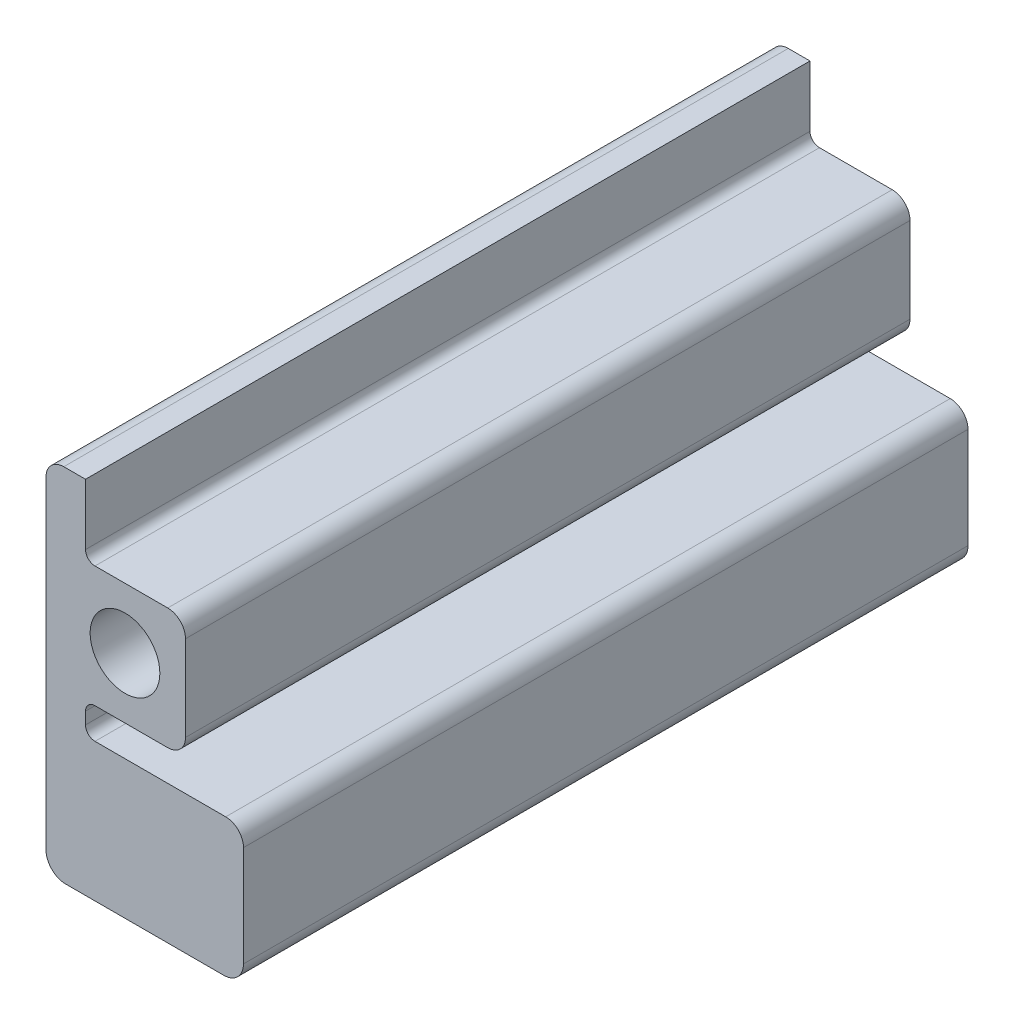
ISO-10303-21;
HEADER;
FILE_DESCRIPTION(('STEP AP214'),'2;1');
FILE_NAME('part.step','',(''),(''),'','','');
FILE_SCHEMA(('AUTOMOTIVE_DESIGN { 1 0 10303 214 1 1 1 1 }'));
ENDSEC;
DATA;
#1=APPLICATION_CONTEXT('core data for automotive mechanical design processes');
#2=APPLICATION_PROTOCOL_DEFINITION('international standard','automotive_design',2000,#1);
#3=PRODUCT_CONTEXT('',#1,'mechanical');
#4=PRODUCT('Part','Part','',(#3));
#5=PRODUCT_RELATED_PRODUCT_CATEGORY('part','',(#4));
#6=PRODUCT_DEFINITION_FORMATION('','',#4);
#7=PRODUCT_DEFINITION_CONTEXT('part definition',#1,'design');
#8=PRODUCT_DEFINITION('design','',#6,#7);
#9=PRODUCT_DEFINITION_SHAPE('','',#8);
#10=(LENGTH_UNIT() NAMED_UNIT(*) SI_UNIT(.MILLI.,.METRE.));
#11=(NAMED_UNIT(*) PLANE_ANGLE_UNIT() SI_UNIT($,.RADIAN.));
#12=(NAMED_UNIT(*) SI_UNIT($,.STERADIAN.) SOLID_ANGLE_UNIT());
#13=UNCERTAINTY_MEASURE_WITH_UNIT(LENGTH_MEASURE(1.E-05),#10,'distance_accuracy_value','');
#14=(GEOMETRIC_REPRESENTATION_CONTEXT(3) GLOBAL_UNCERTAINTY_ASSIGNED_CONTEXT((#13)) GLOBAL_UNIT_ASSIGNED_CONTEXT((#10,
#11,#12)) REPRESENTATION_CONTEXT('',''));
#15=CARTESIAN_POINT('',(0.,0.,0.));
#16=DIRECTION('',(0.,0.,1.));
#17=DIRECTION('',(1.,0.,0.));
#18=AXIS2_PLACEMENT_3D('',#15,#16,#17);
#19=CARTESIAN_POINT('',(-9.65199999999999,-22.503,232.947291788));
#20=DIRECTION('',(0.,0.,-1.));
#21=DIRECTION('',(-1.,0.,0.));
#22=AXIS2_PLACEMENT_3D('',#19,#20,#21);
#23=PLANE('',#22);
#24=DIRECTION('',(0.,1.,0.));
#25=VECTOR('',#24,1.);
#26=CARTESIAN_POINT('',(-12.7,22.503,232.947291788));
#27=LINE('',#26,#25);
#28=CARTESIAN_POINT('',(-12.7,22.503,232.947291788));
#29=VERTEX_POINT('',#28);
#30=CARTESIAN_POINT('',(-12.7,42.08,232.947291788));
#31=VERTEX_POINT('',#30);
#32=EDGE_CURVE('E322',#29,#31,#27,.T.);
#33=ORIENTED_EDGE('',*,*,#32,.T.);
#34=DIRECTION('',(-1.,0.,0.));
#35=VECTOR('',#34,1.);
#36=CARTESIAN_POINT('',(32.385,42.08,232.947291788));
#37=LINE('',#36,#35);
#38=CARTESIAN_POINT('',(-19.685,42.08,232.947291788));
#39=VERTEX_POINT('',#38);
#40=EDGE_CURVE('E324',#31,#39,#37,.T.);
#41=ORIENTED_EDGE('',*,*,#40,.T.);
#42=CARTESIAN_POINT('',(-19.685,36.365,232.947291788));
#43=DIRECTION('',(0.,0.,1.));
#44=DIRECTION('',(1.,0.,0.));
#45=AXIS2_PLACEMENT_3D('',#42,#43,#44);
#46=CIRCLE('',#45,5.71499999999999);
#47=CARTESIAN_POINT('',(-25.4,36.365,232.947291788));
#48=VERTEX_POINT('',#47);
#49=EDGE_CURVE('E326',#39,#48,#46,.T.);
#50=ORIENTED_EDGE('',*,*,#49,.T.);
#51=DIRECTION('',(0.,-1.,0.));
#52=VECTOR('',#51,1.);
#53=CARTESIAN_POINT('',(-25.4,-67.479999962,232.947291788));
#54=LINE('',#53,#52);
#55=CARTESIAN_POINT('',(-25.4,-67.479999962,232.947291788));
#56=VERTEX_POINT('',#55);
#57=EDGE_CURVE('E328',#48,#56,#54,.T.);
#58=ORIENTED_EDGE('',*,*,#57,.T.);
#59=CARTESIAN_POINT('',(-19.05,-67.479999962,232.947291788));
#60=DIRECTION('',(0.,0.,1.));
#61=DIRECTION('',(-1.,0.,0.));
#62=AXIS2_PLACEMENT_3D('',#59,#60,#61);
#63=CIRCLE('',#62,6.35);
#64=CARTESIAN_POINT('',(-19.05,-73.829999962,232.947291788));
#65=VERTEX_POINT('',#64);
#66=EDGE_CURVE('E330',#56,#65,#63,.T.);
#67=ORIENTED_EDGE('',*,*,#66,.T.);
#68=DIRECTION('',(1.,0.,0.));
#69=VECTOR('',#68,1.);
#70=CARTESIAN_POINT('',(31.75,-73.829999962,232.947291788));
#71=LINE('',#70,#69);
#72=CARTESIAN_POINT('',(31.75,-73.829999962,232.947291788));
#73=VERTEX_POINT('',#72);
#74=EDGE_CURVE('E332',#65,#73,#71,.T.);
#75=ORIENTED_EDGE('',*,*,#74,.T.);
#76=CARTESIAN_POINT('',(31.75,-67.479999962,232.947291788));
#77=DIRECTION('',(0.,0.,1.));
#78=DIRECTION('',(1.,0.,0.));
#79=AXIS2_PLACEMENT_3D('',#76,#77,#78);
#80=CIRCLE('',#79,6.35);
#81=CARTESIAN_POINT('',(38.1,-67.479999962,232.947291788));
#82=VERTEX_POINT('',#81);
#83=EDGE_CURVE('E334',#73,#82,#80,.T.);
#84=ORIENTED_EDGE('',*,*,#83,.T.);
#85=DIRECTION('',(0.,1.,0.));
#86=VECTOR('',#85,1.);
#87=CARTESIAN_POINT('',(38.1,-67.479999962,232.947291788));
#88=LINE('',#87,#86);
#89=CARTESIAN_POINT('',(38.1,-35.094999962,232.947291788));
#90=VERTEX_POINT('',#89);
#91=EDGE_CURVE('E336',#82,#90,#88,.T.);
#92=ORIENTED_EDGE('',*,*,#91,.T.);
#93=CARTESIAN_POINT('',(32.385,-35.094999962,232.947291788));
#94=DIRECTION('',(0.,0.,1.));
#95=DIRECTION('',(1.,0.,0.));
#96=AXIS2_PLACEMENT_3D('',#93,#94,#95);
#97=CIRCLE('',#96,5.71499999999999);
#98=CARTESIAN_POINT('',(32.385,-29.379999962,232.947291788));
#99=VERTEX_POINT('',#98);
#100=EDGE_CURVE('E338',#90,#99,#97,.T.);
#101=ORIENTED_EDGE('',*,*,#100,.T.);
#102=DIRECTION('',(-1.,0.,0.));
#103=VECTOR('',#102,1.);
#104=CARTESIAN_POINT('',(32.385,-29.379999962,232.947291788));
#105=LINE('',#104,#103);
#106=CARTESIAN_POINT('',(-9.65199999999999,-29.379999962,232.947291788));
#107=VERTEX_POINT('',#106);
#108=EDGE_CURVE('E194',#99,#107,#105,.T.);
#109=ORIENTED_EDGE('',*,*,#108,.T.);
#110=CARTESIAN_POINT('',(-9.65199999999999,-26.331999962,232.947291788));
#111=DIRECTION('',(0.,0.,-1.));
#112=DIRECTION('',(-1.,0.,0.));
#113=AXIS2_PLACEMENT_3D('',#110,#111,#112);
#114=CIRCLE('',#113,3.048);
#115=CARTESIAN_POINT('',(-12.7,-26.331999962,232.947291788));
#116=VERTEX_POINT('',#115);
#117=EDGE_CURVE('E186',#107,#116,#114,.T.);
#118=ORIENTED_EDGE('',*,*,#117,.T.);
#119=DIRECTION('',(0.,1.,0.));
#120=VECTOR('',#119,1.);
#121=CARTESIAN_POINT('',(-12.7,-26.331999962,232.947291788));
#122=LINE('',#121,#120);
#123=CARTESIAN_POINT('',(-12.7,-22.503,232.947291788));
#124=VERTEX_POINT('',#123);
#125=EDGE_CURVE('E191',#116,#124,#122,.T.);
#126=ORIENTED_EDGE('',*,*,#125,.T.);
#127=CARTESIAN_POINT('',(-9.65199999999999,-22.503,232.947291788));
#128=DIRECTION('',(0.,0.,-1.));
#129=DIRECTION('',(-1.,0.,0.));
#130=AXIS2_PLACEMENT_3D('',#127,#128,#129);
#131=CIRCLE('',#130,3.048);
#132=CARTESIAN_POINT('',(-9.65199999999999,-19.455,232.947291788));
#133=VERTEX_POINT('',#132);
#134=EDGE_CURVE('E211',#124,#133,#131,.T.);
#135=ORIENTED_EDGE('',*,*,#134,.T.);
#136=DIRECTION('',(1.,0.,0.));
#137=VECTOR('',#136,1.);
#138=CARTESIAN_POINT('',(13.74,-19.455,232.947291788));
#139=LINE('',#138,#137);
#140=CARTESIAN_POINT('',(13.74,-19.455,232.947291788));
#141=VERTEX_POINT('',#140);
#142=EDGE_CURVE('E68',#133,#141,#139,.T.);
#143=ORIENTED_EDGE('',*,*,#142,.T.);
#144=CARTESIAN_POINT('',(13.74,-13.74,232.947291788));
#145=DIRECTION('',(0.,0.,1.));
#146=DIRECTION('',(-1.,0.,0.));
#147=AXIS2_PLACEMENT_3D('',#144,#145,#146);
#148=CIRCLE('',#147,5.715);
#149=CARTESIAN_POINT('',(19.455,-13.74,232.947291788));
#150=VERTEX_POINT('',#149);
#151=EDGE_CURVE('E141',#141,#150,#148,.T.);
#152=ORIENTED_EDGE('',*,*,#151,.T.);
#153=DIRECTION('',(0.,1.,0.));
#154=VECTOR('',#153,1.);
#155=CARTESIAN_POINT('',(19.455,0.,232.947291788));
#156=LINE('',#155,#154);
#157=CARTESIAN_POINT('',(19.455,13.74,232.947291788));
#158=VERTEX_POINT('',#157);
#159=EDGE_CURVE('E314',#150,#158,#156,.T.);
#160=ORIENTED_EDGE('',*,*,#159,.T.);
#161=CARTESIAN_POINT('',(13.74,13.74,232.947291788));
#162=DIRECTION('',(0.,0.,1.));
#163=DIRECTION('',(-1.,0.,0.));
#164=AXIS2_PLACEMENT_3D('',#161,#162,#163);
#165=CIRCLE('',#164,5.715);
#166=CARTESIAN_POINT('',(13.74,19.455,232.947291788));
#167=VERTEX_POINT('',#166);
#168=EDGE_CURVE('E311',#158,#167,#165,.T.);
#169=ORIENTED_EDGE('',*,*,#168,.T.);
#170=DIRECTION('',(-1.,0.,0.));
#171=VECTOR('',#170,1.);
#172=CARTESIAN_POINT('',(0.,19.455,232.947291788));
#173=LINE('',#172,#171);
#174=CARTESIAN_POINT('',(-9.65199999999999,19.455,232.947291788));
#175=VERTEX_POINT('',#174);
#176=EDGE_CURVE('E313',#167,#175,#173,.T.);
#177=ORIENTED_EDGE('',*,*,#176,.T.);
#178=CARTESIAN_POINT('',(-9.65199999999999,22.503,232.947291788));
#179=DIRECTION('',(0.,0.,-1.));
#180=DIRECTION('',(-1.,0.,0.));
#181=AXIS2_PLACEMENT_3D('',#178,#179,#180);
#182=CIRCLE('',#181,3.048);
#183=EDGE_CURVE('E316',#175,#29,#182,.T.);
#184=ORIENTED_EDGE('',*,*,#183,.T.);
#185=EDGE_LOOP('',(#33,#41,#50,#58,#67,#75,#84,#92,#101,#109,#118,#126,#135,#143,#152,#160,#169,
#177,#184));
#186=FACE_BOUND('',#185,.T.);
#187=CARTESIAN_POINT('',(0.,0.,232.947291788));
#188=DIRECTION('',(0.,0.,1.));
#189=DIRECTION('',(1.,0.,0.));
#190=AXIS2_PLACEMENT_3D('',#187,#188,#189);
#191=CIRCLE('',#190,11.2);
#192=CARTESIAN_POINT('',(11.2,0.,232.947291788));
#193=VERTEX_POINT('',#192);
#194=EDGE_CURVE('E221',#193,#193,#191,.T.);
#195=ORIENTED_EDGE('',*,*,#194,.F.);
#196=EDGE_LOOP('',(#195));
#197=FACE_BOUND('',#196,.T.);
#198=ADVANCED_FACE('F45',(#186,#197),#23,.F.);
#199=CARTESIAN_POINT('',(-9.65199999999999,-22.503,0.));
#200=DIRECTION('',(0.,0.,-1.));
#201=DIRECTION('',(-1.,0.,0.));
#202=AXIS2_PLACEMENT_3D('',#199,#200,#201);
#203=PLANE('',#202);
#204=DIRECTION('',(-1.,0.,0.));
#205=VECTOR('',#204,1.);
#206=CARTESIAN_POINT('',(32.385,42.08,0.));
#207=LINE('',#206,#205);
#208=CARTESIAN_POINT('',(-12.7,42.08,0.));
#209=VERTEX_POINT('',#208);
#210=CARTESIAN_POINT('',(-19.685,42.08,0.));
#211=VERTEX_POINT('',#210);
#212=EDGE_CURVE('E231',#209,#211,#207,.T.);
#213=ORIENTED_EDGE('',*,*,#212,.F.);
#214=DIRECTION('',(0.,1.,0.));
#215=VECTOR('',#214,1.);
#216=CARTESIAN_POINT('',(-12.7,22.503,0.));
#217=LINE('',#216,#215);
#218=CARTESIAN_POINT('',(-12.7,22.503,0.));
#219=VERTEX_POINT('',#218);
#220=EDGE_CURVE('E60',#219,#209,#217,.T.);
#221=ORIENTED_EDGE('',*,*,#220,.F.);
#222=CARTESIAN_POINT('',(-9.65199999999999,22.503,0.));
#223=DIRECTION('',(0.,0.,-1.));
#224=DIRECTION('',(-1.,0.,0.));
#225=AXIS2_PLACEMENT_3D('',#222,#223,#224);
#226=CIRCLE('',#225,3.048);
#227=CARTESIAN_POINT('',(-9.65199999999999,19.455,0.));
#228=VERTEX_POINT('',#227);
#229=EDGE_CURVE('E228',#228,#219,#226,.T.);
#230=ORIENTED_EDGE('',*,*,#229,.F.);
#231=DIRECTION('',(-1.,0.,0.));
#232=VECTOR('',#231,1.);
#233=CARTESIAN_POINT('',(-9.65199999999999,19.455,0.));
#234=LINE('',#233,#232);
#235=CARTESIAN_POINT('',(13.74,19.455,0.));
#236=VERTEX_POINT('',#235);
#237=EDGE_CURVE('E226',#236,#228,#234,.T.);
#238=ORIENTED_EDGE('',*,*,#237,.F.);
#239=CARTESIAN_POINT('',(13.74,13.74,0.));
#240=DIRECTION('',(0.,0.,1.));
#241=DIRECTION('',(-1.,0.,0.));
#242=AXIS2_PLACEMENT_3D('',#239,#240,#241);
#243=CIRCLE('',#242,5.715);
#244=CARTESIAN_POINT('',(19.455,13.74,0.));
#245=VERTEX_POINT('',#244);
#246=EDGE_CURVE('E223',#245,#236,#243,.T.);
#247=ORIENTED_EDGE('',*,*,#246,.F.);
#248=DIRECTION('',(0.,1.,0.));
#249=VECTOR('',#248,1.);
#250=CARTESIAN_POINT('',(19.455,13.74,0.));
#251=LINE('',#250,#249);
#252=CARTESIAN_POINT('',(19.455,-13.74,0.));
#253=VERTEX_POINT('',#252);
#254=EDGE_CURVE('E220',#253,#245,#251,.T.);
#255=ORIENTED_EDGE('',*,*,#254,.F.);
#256=CARTESIAN_POINT('',(13.74,-13.74,0.));
#257=DIRECTION('',(0.,0.,1.));
#258=DIRECTION('',(-1.,0.,0.));
#259=AXIS2_PLACEMENT_3D('',#256,#257,#258);
#260=CIRCLE('',#259,5.715);
#261=CARTESIAN_POINT('',(13.74,-19.455,0.));
#262=VERTEX_POINT('',#261);
#263=EDGE_CURVE('E217',#262,#253,#260,.T.);
#264=ORIENTED_EDGE('',*,*,#263,.F.);
#265=DIRECTION('',(1.,0.,0.));
#266=VECTOR('',#265,1.);
#267=CARTESIAN_POINT('',(-9.65199999999999,-19.455,0.));
#268=LINE('',#267,#266);
#269=CARTESIAN_POINT('',(-9.65199999999999,-19.455,0.));
#270=VERTEX_POINT('',#269);
#271=EDGE_CURVE('E253',#270,#262,#268,.T.);
#272=ORIENTED_EDGE('',*,*,#271,.F.);
#273=CARTESIAN_POINT('',(-9.65199999999999,-22.503,0.));
#274=DIRECTION('',(0.,0.,-1.));
#275=DIRECTION('',(-1.,0.,0.));
#276=AXIS2_PLACEMENT_3D('',#273,#274,#275);
#277=CIRCLE('',#276,3.048);
#278=CARTESIAN_POINT('',(-12.7,-22.503,0.));
#279=VERTEX_POINT('',#278);
#280=EDGE_CURVE('E133',#279,#270,#277,.T.);
#281=ORIENTED_EDGE('',*,*,#280,.F.);
#282=DIRECTION('',(0.,1.,0.));
#283=VECTOR('',#282,1.);
#284=CARTESIAN_POINT('',(-12.7,-26.331999962,0.));
#285=LINE('',#284,#283);
#286=CARTESIAN_POINT('',(-12.7,-26.331999962,0.));
#287=VERTEX_POINT('',#286);
#288=EDGE_CURVE('E250',#287,#279,#285,.T.);
#289=ORIENTED_EDGE('',*,*,#288,.F.);
#290=CARTESIAN_POINT('',(-9.65199999999999,-26.331999962,0.));
#291=DIRECTION('',(0.,0.,-1.));
#292=DIRECTION('',(-1.,0.,0.));
#293=AXIS2_PLACEMENT_3D('',#290,#291,#292);
#294=CIRCLE('',#293,3.048);
#295=CARTESIAN_POINT('',(-9.65199999999999,-29.379999962,0.));
#296=VERTEX_POINT('',#295);
#297=EDGE_CURVE('E203',#296,#287,#294,.T.);
#298=ORIENTED_EDGE('',*,*,#297,.F.);
#299=DIRECTION('',(-1.,0.,0.));
#300=VECTOR('',#299,1.);
#301=CARTESIAN_POINT('',(32.385,-29.379999962,0.));
#302=LINE('',#301,#300);
#303=CARTESIAN_POINT('',(32.385,-29.379999962,0.));
#304=VERTEX_POINT('',#303);
#305=EDGE_CURVE('E247',#304,#296,#302,.T.);
#306=ORIENTED_EDGE('',*,*,#305,.F.);
#307=CARTESIAN_POINT('',(32.385,-35.094999962,0.));
#308=DIRECTION('',(0.,0.,1.));
#309=DIRECTION('',(1.,0.,0.));
#310=AXIS2_PLACEMENT_3D('',#307,#308,#309);
#311=CIRCLE('',#310,5.71499999999999);
#312=CARTESIAN_POINT('',(38.1,-35.094999962,0.));
#313=VERTEX_POINT('',#312);
#314=EDGE_CURVE('E245',#313,#304,#311,.T.);
#315=ORIENTED_EDGE('',*,*,#314,.F.);
#316=DIRECTION('',(0.,1.,0.));
#317=VECTOR('',#316,1.);
#318=CARTESIAN_POINT('',(38.1,-67.479999962,0.));
#319=LINE('',#318,#317);
#320=CARTESIAN_POINT('',(38.1,-67.479999962,0.));
#321=VERTEX_POINT('',#320);
#322=EDGE_CURVE('E243',#321,#313,#319,.T.);
#323=ORIENTED_EDGE('',*,*,#322,.F.);
#324=CARTESIAN_POINT('',(31.75,-67.479999962,0.));
#325=DIRECTION('',(0.,0.,1.));
#326=DIRECTION('',(1.,0.,0.));
#327=AXIS2_PLACEMENT_3D('',#324,#325,#326);
#328=CIRCLE('',#327,6.35);
#329=CARTESIAN_POINT('',(31.75,-73.829999962,0.));
#330=VERTEX_POINT('',#329);
#331=EDGE_CURVE('E241',#330,#321,#328,.T.);
#332=ORIENTED_EDGE('',*,*,#331,.F.);
#333=DIRECTION('',(1.,0.,0.));
#334=VECTOR('',#333,1.);
#335=CARTESIAN_POINT('',(31.75,-73.829999962,0.));
#336=LINE('',#335,#334);
#337=CARTESIAN_POINT('',(-19.05,-73.829999962,0.));
#338=VERTEX_POINT('',#337);
#339=EDGE_CURVE('E239',#338,#330,#336,.T.);
#340=ORIENTED_EDGE('',*,*,#339,.F.);
#341=CARTESIAN_POINT('',(-19.05,-67.479999962,0.));
#342=DIRECTION('',(0.,0.,1.));
#343=DIRECTION('',(-1.,0.,0.));
#344=AXIS2_PLACEMENT_3D('',#341,#342,#343);
#345=CIRCLE('',#344,6.35);
#346=CARTESIAN_POINT('',(-25.4,-67.479999962,0.));
#347=VERTEX_POINT('',#346);
#348=EDGE_CURVE('E237',#347,#338,#345,.T.);
#349=ORIENTED_EDGE('',*,*,#348,.F.);
#350=DIRECTION('',(0.,-1.,0.));
#351=VECTOR('',#350,1.);
#352=CARTESIAN_POINT('',(-25.4,-67.479999962,0.));
#353=LINE('',#352,#351);
#354=CARTESIAN_POINT('',(-25.4,36.365,0.));
#355=VERTEX_POINT('',#354);
#356=EDGE_CURVE('E235',#355,#347,#353,.T.);
#357=ORIENTED_EDGE('',*,*,#356,.F.);
#358=CARTESIAN_POINT('',(-19.685,36.365,0.));
#359=DIRECTION('',(0.,0.,1.));
#360=DIRECTION('',(1.,0.,0.));
#361=AXIS2_PLACEMENT_3D('',#358,#359,#360);
#362=CIRCLE('',#361,5.71499999999999);
#363=EDGE_CURVE('E233',#211,#355,#362,.T.);
#364=ORIENTED_EDGE('',*,*,#363,.F.);
#365=EDGE_LOOP('',(#213,#221,#230,#238,#247,#255,#264,#272,#281,#289,#298,#306,#315,#323,#332,
#340,#349,#357,#364));
#366=FACE_BOUND('',#365,.T.);
#367=CARTESIAN_POINT('',(0.,0.,0.));
#368=DIRECTION('',(0.,0.,1.));
#369=DIRECTION('',(1.,0.,0.));
#370=AXIS2_PLACEMENT_3D('',#367,#368,#369);
#371=CIRCLE('',#370,11.2);
#372=CARTESIAN_POINT('',(11.2,0.,0.));
#373=VERTEX_POINT('',#372);
#374=EDGE_CURVE('E352',#373,#373,#371,.T.);
#375=ORIENTED_EDGE('',*,*,#374,.T.);
#376=EDGE_LOOP('',(#375));
#377=FACE_BOUND('',#376,.T.);
#378=ADVANCED_FACE('F300',(#366,#377),#203,.T.);
#379=CARTESIAN_POINT('',(13.74,-13.74,232.947291788));
#380=DIRECTION('',(0.,0.,-1.));
#381=DIRECTION('',(-1.,0.,0.));
#382=AXIS2_PLACEMENT_3D('',#379,#380,#381);
#383=CYLINDRICAL_SURFACE('',#382,5.715);
#384=ORIENTED_EDGE('',*,*,#263,.T.);
#385=DIRECTION('',(0.,0.,-1.));
#386=VECTOR('',#385,1.);
#387=CARTESIAN_POINT('',(19.455,-13.74,232.947291788));
#388=LINE('',#387,#386);
#389=EDGE_CURVE('E293',#150,#253,#388,.T.);
#390=ORIENTED_EDGE('',*,*,#389,.F.);
#391=ORIENTED_EDGE('',*,*,#151,.F.);
#392=DIRECTION('',(0.,0.,-1.));
#393=VECTOR('',#392,1.);
#394=CARTESIAN_POINT('',(13.74,-19.455,232.947291788));
#395=LINE('',#394,#393);
#396=EDGE_CURVE('E53',#141,#262,#395,.T.);
#397=ORIENTED_EDGE('',*,*,#396,.T.);
#398=EDGE_LOOP('',(#384,#390,#391,#397));
#399=FACE_BOUND('',#398,.T.);
#400=ADVANCED_FACE('F47',(#399),#383,.T.);
#401=CARTESIAN_POINT('',(19.455,13.74,232.947291788));
#402=DIRECTION('',(-1.,0.,0.));
#403=DIRECTION('',(0.,0.,1.));
#404=AXIS2_PLACEMENT_3D('',#401,#402,#403);
#405=PLANE('',#404);
#406=ORIENTED_EDGE('',*,*,#254,.T.);
#407=DIRECTION('',(0.,0.,-1.));
#408=VECTOR('',#407,1.);
#409=CARTESIAN_POINT('',(19.455,13.74,232.947291788));
#410=LINE('',#409,#408);
#411=EDGE_CURVE('E290',#158,#245,#410,.T.);
#412=ORIENTED_EDGE('',*,*,#411,.F.);
#413=ORIENTED_EDGE('',*,*,#159,.F.);
#414=ORIENTED_EDGE('',*,*,#389,.T.);
#415=EDGE_LOOP('',(#406,#412,#413,#414));
#416=FACE_BOUND('',#415,.T.);
#417=ADVANCED_FACE('F305',(#416),#405,.F.);
#418=CARTESIAN_POINT('',(13.74,13.74,232.947291788));
#419=DIRECTION('',(0.,0.,-1.));
#420=DIRECTION('',(-1.,0.,0.));
#421=AXIS2_PLACEMENT_3D('',#418,#419,#420);
#422=CYLINDRICAL_SURFACE('',#421,5.715);
#423=ORIENTED_EDGE('',*,*,#246,.T.);
#424=DIRECTION('',(0.,0.,-1.));
#425=VECTOR('',#424,1.);
#426=CARTESIAN_POINT('',(13.74,19.455,232.947291788));
#427=LINE('',#426,#425);
#428=EDGE_CURVE('E287',#167,#236,#427,.T.);
#429=ORIENTED_EDGE('',*,*,#428,.F.);
#430=ORIENTED_EDGE('',*,*,#168,.F.);
#431=ORIENTED_EDGE('',*,*,#411,.T.);
#432=EDGE_LOOP('',(#423,#429,#430,#431));
#433=FACE_BOUND('',#432,.T.);
#434=ADVANCED_FACE('F309',(#433),#422,.T.);
#435=CARTESIAN_POINT('',(-9.65199999999999,19.455,232.947291788));
#436=DIRECTION('',(0.,-1.,0.));
#437=DIRECTION('',(1.,0.,0.));
#438=AXIS2_PLACEMENT_3D('',#435,#436,#437);
#439=PLANE('',#438);
#440=ORIENTED_EDGE('',*,*,#237,.T.);
#441=DIRECTION('',(0.,0.,-1.));
#442=VECTOR('',#441,1.);
#443=CARTESIAN_POINT('',(-9.65199999999999,19.455,232.947291788));
#444=LINE('',#443,#442);
#445=EDGE_CURVE('E284',#175,#228,#444,.T.);
#446=ORIENTED_EDGE('',*,*,#445,.F.);
#447=ORIENTED_EDGE('',*,*,#176,.F.);
#448=ORIENTED_EDGE('',*,*,#428,.T.);
#449=EDGE_LOOP('',(#440,#446,#447,#448));
#450=FACE_BOUND('',#449,.T.);
#451=ADVANCED_FACE('F415',(#450),#439,.F.);
#452=CARTESIAN_POINT('',(-9.65199999999999,22.503,232.947291788));
#453=DIRECTION('',(0.,0.,-1.));
#454=DIRECTION('',(-1.,0.,0.));
#455=AXIS2_PLACEMENT_3D('',#452,#453,#454);
#456=CYLINDRICAL_SURFACE('',#455,3.048);
#457=ORIENTED_EDGE('',*,*,#229,.T.);
#458=DIRECTION('',(0.,0.,-1.));
#459=VECTOR('',#458,1.);
#460=CARTESIAN_POINT('',(-12.7,22.503,232.947291788));
#461=LINE('',#460,#459);
#462=EDGE_CURVE('E282',#29,#219,#461,.T.);
#463=ORIENTED_EDGE('',*,*,#462,.F.);
#464=ORIENTED_EDGE('',*,*,#183,.F.);
#465=ORIENTED_EDGE('',*,*,#445,.T.);
#466=EDGE_LOOP('',(#457,#463,#464,#465));
#467=FACE_BOUND('',#466,.T.);
#468=ADVANCED_FACE('F412',(#467),#456,.F.);
#469=CARTESIAN_POINT('',(-12.7,22.503,232.947291788));
#470=DIRECTION('',(-1.,0.,0.));
#471=DIRECTION('',(0.,0.,1.));
#472=AXIS2_PLACEMENT_3D('',#469,#470,#471);
#473=PLANE('',#472);
#474=ORIENTED_EDGE('',*,*,#220,.T.);
#475=DIRECTION('',(0.,0.,-1.));
#476=VECTOR('',#475,1.);
#477=CARTESIAN_POINT('',(-12.7,42.08,232.947291788));
#478=LINE('',#477,#476);
#479=EDGE_CURVE('E11',#31,#209,#478,.T.);
#480=ORIENTED_EDGE('',*,*,#479,.F.);
#481=ORIENTED_EDGE('',*,*,#32,.F.);
#482=ORIENTED_EDGE('',*,*,#462,.T.);
#483=EDGE_LOOP('',(#474,#480,#481,#482));
#484=FACE_BOUND('',#483,.T.);
#485=ADVANCED_FACE('F408',(#484),#473,.F.);
#486=CARTESIAN_POINT('',(32.385,42.08,232.947291788));
#487=DIRECTION('',(0.,-1.,0.));
#488=DIRECTION('',(1.,0.,0.));
#489=AXIS2_PLACEMENT_3D('',#486,#487,#488);
#490=PLANE('',#489);
#491=ORIENTED_EDGE('',*,*,#40,.F.);
#492=ORIENTED_EDGE('',*,*,#479,.T.);
#493=ORIENTED_EDGE('',*,*,#212,.T.);
#494=DIRECTION('',(0.,0.,-1.));
#495=VECTOR('',#494,1.);
#496=CARTESIAN_POINT('',(-19.685,42.08,232.947291788));
#497=LINE('',#496,#495);
#498=EDGE_CURVE('E279',#39,#211,#497,.T.);
#499=ORIENTED_EDGE('',*,*,#498,.F.);
#500=EDGE_LOOP('',(#491,#492,#493,#499));
#501=FACE_BOUND('',#500,.T.);
#502=ADVANCED_FACE('F404',(#501),#490,.F.);
#503=CARTESIAN_POINT('',(-19.685,36.365,232.947291788));
#504=DIRECTION('',(0.,0.,-1.));
#505=DIRECTION('',(-1.,0.,0.));
#506=AXIS2_PLACEMENT_3D('',#503,#504,#505);
#507=CYLINDRICAL_SURFACE('',#506,5.71499999999999);
#508=ORIENTED_EDGE('',*,*,#363,.T.);
#509=DIRECTION('',(0.,0.,-1.));
#510=VECTOR('',#509,1.);
#511=CARTESIAN_POINT('',(-25.4,36.365,232.947291788));
#512=LINE('',#511,#510);
#513=EDGE_CURVE('E276',#48,#355,#512,.T.);
#514=ORIENTED_EDGE('',*,*,#513,.F.);
#515=ORIENTED_EDGE('',*,*,#49,.F.);
#516=ORIENTED_EDGE('',*,*,#498,.T.);
#517=EDGE_LOOP('',(#508,#514,#515,#516));
#518=FACE_BOUND('',#517,.T.);
#519=ADVANCED_FACE('F400',(#518),#507,.T.);
#520=CARTESIAN_POINT('',(-25.4,-67.479999962,232.947291788));
#521=DIRECTION('',(1.,0.,0.));
#522=DIRECTION('',(0.,1.,0.));
#523=AXIS2_PLACEMENT_3D('',#520,#521,#522);
#524=PLANE('',#523);
#525=ORIENTED_EDGE('',*,*,#356,.T.);
#526=DIRECTION('',(0.,0.,-1.));
#527=VECTOR('',#526,1.);
#528=CARTESIAN_POINT('',(-25.4,-67.479999962,232.947291788));
#529=LINE('',#528,#527);
#530=EDGE_CURVE('E273',#56,#347,#529,.T.);
#531=ORIENTED_EDGE('',*,*,#530,.F.);
#532=ORIENTED_EDGE('',*,*,#57,.F.);
#533=ORIENTED_EDGE('',*,*,#513,.T.);
#534=EDGE_LOOP('',(#525,#531,#532,#533));
#535=FACE_BOUND('',#534,.T.);
#536=ADVANCED_FACE('F396',(#535),#524,.F.);
#537=CARTESIAN_POINT('',(-19.05,-67.479999962,232.947291788));
#538=DIRECTION('',(0.,0.,-1.));
#539=DIRECTION('',(-1.,0.,0.));
#540=AXIS2_PLACEMENT_3D('',#537,#538,#539);
#541=CYLINDRICAL_SURFACE('',#540,6.35);
#542=ORIENTED_EDGE('',*,*,#348,.T.);
#543=DIRECTION('',(0.,0.,-1.));
#544=VECTOR('',#543,1.);
#545=CARTESIAN_POINT('',(-19.05,-73.829999962,232.947291788));
#546=LINE('',#545,#544);
#547=EDGE_CURVE('E270',#65,#338,#546,.T.);
#548=ORIENTED_EDGE('',*,*,#547,.F.);
#549=ORIENTED_EDGE('',*,*,#66,.F.);
#550=ORIENTED_EDGE('',*,*,#530,.T.);
#551=EDGE_LOOP('',(#542,#548,#549,#550));
#552=FACE_BOUND('',#551,.T.);
#553=ADVANCED_FACE('F392',(#552),#541,.T.);
#554=CARTESIAN_POINT('',(31.75,-73.829999962,232.947291788));
#555=DIRECTION('',(0.,1.,0.));
#556=DIRECTION('',(0.,0.,1.));
#557=AXIS2_PLACEMENT_3D('',#554,#555,#556);
#558=PLANE('',#557);
#559=ORIENTED_EDGE('',*,*,#339,.T.);
#560=DIRECTION('',(0.,0.,-1.));
#561=VECTOR('',#560,1.);
#562=CARTESIAN_POINT('',(31.75,-73.829999962,232.947291788));
#563=LINE('',#562,#561);
#564=EDGE_CURVE('E267',#73,#330,#563,.T.);
#565=ORIENTED_EDGE('',*,*,#564,.F.);
#566=ORIENTED_EDGE('',*,*,#74,.F.);
#567=ORIENTED_EDGE('',*,*,#547,.T.);
#568=EDGE_LOOP('',(#559,#565,#566,#567));
#569=FACE_BOUND('',#568,.T.);
#570=ADVANCED_FACE('F388',(#569),#558,.F.);
#571=CARTESIAN_POINT('',(31.75,-67.479999962,232.947291788));
#572=DIRECTION('',(0.,0.,-1.));
#573=DIRECTION('',(-1.,0.,0.));
#574=AXIS2_PLACEMENT_3D('',#571,#572,#573);
#575=CYLINDRICAL_SURFACE('',#574,6.35);
#576=ORIENTED_EDGE('',*,*,#331,.T.);
#577=DIRECTION('',(0.,0.,-1.));
#578=VECTOR('',#577,1.);
#579=CARTESIAN_POINT('',(38.1,-67.479999962,232.947291788));
#580=LINE('',#579,#578);
#581=EDGE_CURVE('E264',#82,#321,#580,.T.);
#582=ORIENTED_EDGE('',*,*,#581,.F.);
#583=ORIENTED_EDGE('',*,*,#83,.F.);
#584=ORIENTED_EDGE('',*,*,#564,.T.);
#585=EDGE_LOOP('',(#576,#582,#583,#584));
#586=FACE_BOUND('',#585,.T.);
#587=ADVANCED_FACE('F384',(#586),#575,.T.);
#588=CARTESIAN_POINT('',(38.1,-67.479999962,232.947291788));
#589=DIRECTION('',(-1.,0.,0.));
#590=DIRECTION('',(0.,-1.,0.));
#591=AXIS2_PLACEMENT_3D('',#588,#589,#590);
#592=PLANE('',#591);
#593=ORIENTED_EDGE('',*,*,#322,.T.);
#594=DIRECTION('',(0.,0.,-1.));
#595=VECTOR('',#594,1.);
#596=CARTESIAN_POINT('',(38.1,-35.094999962,232.947291788));
#597=LINE('',#596,#595);
#598=EDGE_CURVE('E261',#90,#313,#597,.T.);
#599=ORIENTED_EDGE('',*,*,#598,.F.);
#600=ORIENTED_EDGE('',*,*,#91,.F.);
#601=ORIENTED_EDGE('',*,*,#581,.T.);
#602=EDGE_LOOP('',(#593,#599,#600,#601));
#603=FACE_BOUND('',#602,.T.);
#604=ADVANCED_FACE('F381',(#603),#592,.F.);
#605=CARTESIAN_POINT('',(32.385,-35.094999962,232.947291788));
#606=DIRECTION('',(0.,0.,-1.));
#607=DIRECTION('',(-1.,0.,0.));
#608=AXIS2_PLACEMENT_3D('',#605,#606,#607);
#609=CYLINDRICAL_SURFACE('',#608,5.71499999999999);
#610=ORIENTED_EDGE('',*,*,#314,.T.);
#611=DIRECTION('',(0.,0.,-1.));
#612=VECTOR('',#611,1.);
#613=CARTESIAN_POINT('',(32.385,-29.379999962,232.947291788));
#614=LINE('',#613,#612);
#615=EDGE_CURVE('E258',#99,#304,#614,.T.);
#616=ORIENTED_EDGE('',*,*,#615,.F.);
#617=ORIENTED_EDGE('',*,*,#100,.F.);
#618=ORIENTED_EDGE('',*,*,#598,.T.);
#619=EDGE_LOOP('',(#610,#616,#617,#618));
#620=FACE_BOUND('',#619,.T.);
#621=ADVANCED_FACE('F344',(#620),#609,.T.);
#622=CARTESIAN_POINT('',(32.385,-29.379999962,232.947291788));
#623=DIRECTION('',(0.,-1.,0.));
#624=DIRECTION('',(1.,0.,0.));
#625=AXIS2_PLACEMENT_3D('',#622,#623,#624);
#626=PLANE('',#625);
#627=ORIENTED_EDGE('',*,*,#305,.T.);
#628=DIRECTION('',(0.,0.,-1.));
#629=VECTOR('',#628,1.);
#630=CARTESIAN_POINT('',(-9.65199999999999,-29.379999962,232.947291788));
#631=LINE('',#630,#629);
#632=EDGE_CURVE('E206',#107,#296,#631,.T.);
#633=ORIENTED_EDGE('',*,*,#632,.F.);
#634=ORIENTED_EDGE('',*,*,#108,.F.);
#635=ORIENTED_EDGE('',*,*,#615,.T.);
#636=EDGE_LOOP('',(#627,#633,#634,#635));
#637=FACE_BOUND('',#636,.T.);
#638=ADVANCED_FACE('F348',(#637),#626,.F.);
#639=CARTESIAN_POINT('',(-9.65199999999999,-26.331999962,232.947291788));
#640=DIRECTION('',(0.,0.,-1.));
#641=DIRECTION('',(-1.,0.,0.));
#642=AXIS2_PLACEMENT_3D('',#639,#640,#641);
#643=CYLINDRICAL_SURFACE('',#642,3.048);
#644=ORIENTED_EDGE('',*,*,#297,.T.);
#645=DIRECTION('',(0.,0.,-1.));
#646=VECTOR('',#645,1.);
#647=CARTESIAN_POINT('',(-12.7,-26.331999962,232.947291788));
#648=LINE('',#647,#646);
#649=EDGE_CURVE('E200',#116,#287,#648,.T.);
#650=ORIENTED_EDGE('',*,*,#649,.F.);
#651=ORIENTED_EDGE('',*,*,#117,.F.);
#652=ORIENTED_EDGE('',*,*,#632,.T.);
#653=EDGE_LOOP('',(#644,#650,#651,#652));
#654=FACE_BOUND('',#653,.T.);
#655=ADVANCED_FACE('F201',(#654),#643,.F.);
#656=CARTESIAN_POINT('',(-12.7,-26.331999962,232.947291788));
#657=DIRECTION('',(-1.,0.,0.));
#658=DIRECTION('',(0.,0.,1.));
#659=AXIS2_PLACEMENT_3D('',#656,#657,#658);
#660=PLANE('',#659);
#661=ORIENTED_EDGE('',*,*,#288,.T.);
#662=DIRECTION('',(0.,0.,-1.));
#663=VECTOR('',#662,1.);
#664=CARTESIAN_POINT('',(-12.7,-22.503,232.947291788));
#665=LINE('',#664,#663);
#666=EDGE_CURVE('E207',#124,#279,#665,.T.);
#667=ORIENTED_EDGE('',*,*,#666,.F.);
#668=ORIENTED_EDGE('',*,*,#125,.F.);
#669=ORIENTED_EDGE('',*,*,#649,.T.);
#670=EDGE_LOOP('',(#661,#667,#668,#669));
#671=FACE_BOUND('',#670,.T.);
#672=ADVANCED_FACE('F209',(#671),#660,.F.);
#673=CARTESIAN_POINT('',(-9.65199999999999,-22.503,232.947291788));
#674=DIRECTION('',(0.,0.,-1.));
#675=DIRECTION('',(-1.,0.,0.));
#676=AXIS2_PLACEMENT_3D('',#673,#674,#675);
#677=CYLINDRICAL_SURFACE('',#676,3.048);
#678=ORIENTED_EDGE('',*,*,#280,.T.);
#679=DIRECTION('',(0.,0.,-1.));
#680=VECTOR('',#679,1.);
#681=CARTESIAN_POINT('',(-9.65199999999999,-19.455,232.947291788));
#682=LINE('',#681,#680);
#683=EDGE_CURVE('E213',#133,#270,#682,.T.);
#684=ORIENTED_EDGE('',*,*,#683,.F.);
#685=ORIENTED_EDGE('',*,*,#134,.F.);
#686=ORIENTED_EDGE('',*,*,#666,.T.);
#687=EDGE_LOOP('',(#678,#684,#685,#686));
#688=FACE_BOUND('',#687,.T.);
#689=ADVANCED_FACE('F349',(#688),#677,.F.);
#690=CARTESIAN_POINT('',(-9.65199999999999,-19.455,232.947291788));
#691=DIRECTION('',(0.,1.,0.));
#692=DIRECTION('',(-1.,0.,0.));
#693=AXIS2_PLACEMENT_3D('',#690,#691,#692);
#694=PLANE('',#693);
#695=ORIENTED_EDGE('',*,*,#271,.T.);
#696=ORIENTED_EDGE('',*,*,#396,.F.);
#697=ORIENTED_EDGE('',*,*,#142,.F.);
#698=ORIENTED_EDGE('',*,*,#683,.T.);
#699=EDGE_LOOP('',(#695,#696,#697,#698));
#700=FACE_BOUND('',#699,.T.);
#701=ADVANCED_FACE('F296',(#700),#694,.F.);
#702=CARTESIAN_POINT('',(0.,0.,232.947291788));
#703=DIRECTION('',(0.,0.,-1.));
#704=DIRECTION('',(-1.,0.,0.));
#705=AXIS2_PLACEMENT_3D('',#702,#703,#704);
#706=CYLINDRICAL_SURFACE('',#705,11.2);
#707=ORIENTED_EDGE('',*,*,#194,.T.);
#708=EDGE_LOOP('',(#707));
#709=FACE_BOUND('',#708,.T.);
#710=ORIENTED_EDGE('',*,*,#374,.F.);
#711=EDGE_LOOP('',(#710));
#712=FACE_BOUND('',#711,.T.);
#713=ADVANCED_FACE('F358',(#709,#712),#706,.F.);
#714=CLOSED_SHELL('',(#198,#378,#400,#417,#434,#451,#468,#485,#502,#519,#536,#553,#570,#587,
#604,#621,#638,#655,#672,#689,#701,#713));
#715=MANIFOLD_SOLID_BREP('B2',#714);
#716=ADVANCED_BREP_SHAPE_REPRESENTATION('',(#18,#715),#14);
#717=SHAPE_DEFINITION_REPRESENTATION(#9,#716);
ENDSEC;
END-ISO-10303-21;
